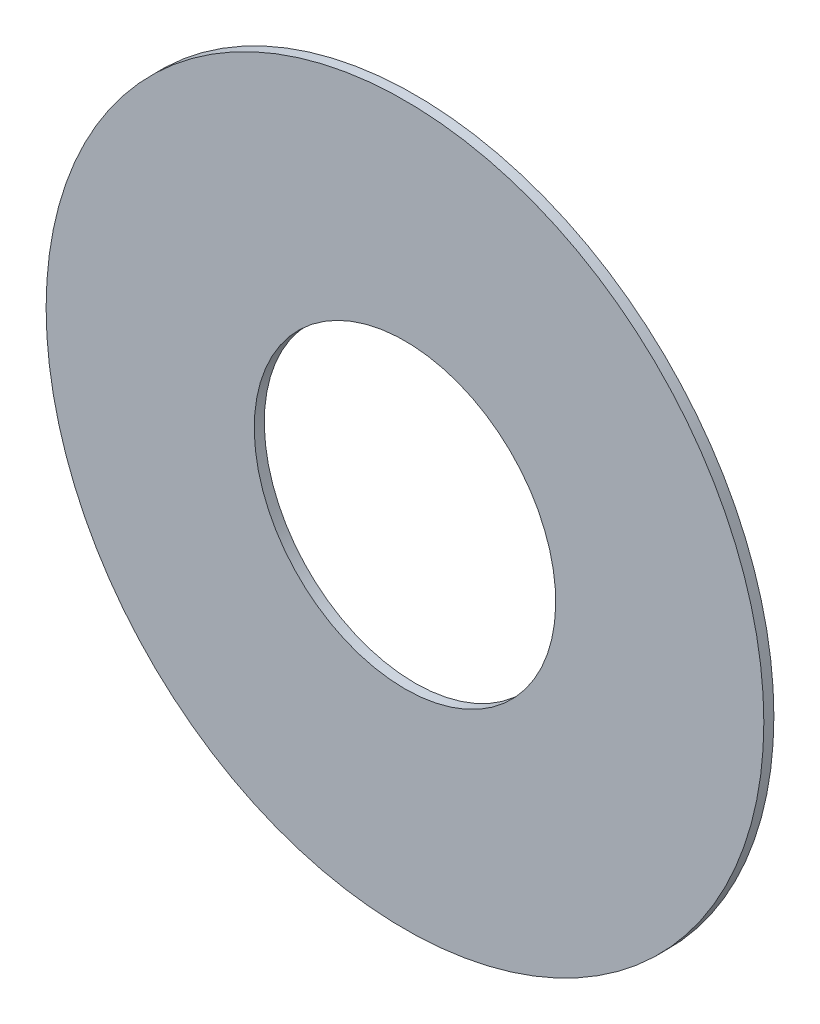
ISO-10303-21;
HEADER;
FILE_DESCRIPTION(('STEP AP214'),'2;1');
FILE_NAME('part.step','',(''),(''),'','','');
FILE_SCHEMA(('AUTOMOTIVE_DESIGN { 1 0 10303 214 1 1 1 1 }'));
ENDSEC;
DATA;
#1=APPLICATION_CONTEXT('core data for automotive mechanical design processes');
#2=APPLICATION_PROTOCOL_DEFINITION('international standard','automotive_design',2000,#1);
#3=PRODUCT_CONTEXT('',#1,'mechanical');
#4=PRODUCT('Part','Part','',(#3));
#5=PRODUCT_RELATED_PRODUCT_CATEGORY('part','',(#4));
#6=PRODUCT_DEFINITION_FORMATION('','',#4);
#7=PRODUCT_DEFINITION_CONTEXT('part definition',#1,'design');
#8=PRODUCT_DEFINITION('design','',#6,#7);
#9=PRODUCT_DEFINITION_SHAPE('','',#8);
#10=(LENGTH_UNIT() NAMED_UNIT(*) SI_UNIT(.MILLI.,.METRE.));
#11=(NAMED_UNIT(*) PLANE_ANGLE_UNIT() SI_UNIT($,.RADIAN.));
#12=(NAMED_UNIT(*) SI_UNIT($,.STERADIAN.) SOLID_ANGLE_UNIT());
#13=UNCERTAINTY_MEASURE_WITH_UNIT(LENGTH_MEASURE(1.E-05),#10,'distance_accuracy_value','');
#14=(GEOMETRIC_REPRESENTATION_CONTEXT(3) GLOBAL_UNCERTAINTY_ASSIGNED_CONTEXT((#13)) GLOBAL_UNIT_ASSIGNED_CONTEXT((#10,
#11,#12)) REPRESENTATION_CONTEXT('',''));
#15=CARTESIAN_POINT('',(0.,0.,0.));
#16=DIRECTION('',(0.,0.,1.));
#17=DIRECTION('',(1.,0.,0.));
#18=AXIS2_PLACEMENT_3D('',#15,#16,#17);
#19=CARTESIAN_POINT('',(123.952,-121.234,-0.045));
#20=DIRECTION('',(0.,0.,-1.));
#21=DIRECTION('',(0.,-1.,0.));
#22=AXIS2_PLACEMENT_3D('',#19,#20,#21);
#23=CYLINDRICAL_SURFACE('',#22,0.525);
#24=CARTESIAN_POINT('',(123.952,-121.234,-0.035));
#25=DIRECTION('',(0.,0.,-1.));
#26=DIRECTION('',(0.,-1.,0.));
#27=AXIS2_PLACEMENT_3D('',#24,#25,#26);
#28=CIRCLE('',#27,0.525);
#29=CARTESIAN_POINT('',(123.952,-121.759,-0.035));
#30=VERTEX_POINT('',#29);
#31=EDGE_CURVE('E25',#30,#30,#28,.T.);
#32=ORIENTED_EDGE('',*,*,#31,.T.);
#33=DIRECTION('',(0.,0.,1.));
#34=VECTOR('',#33,1.);
#35=CARTESIAN_POINT('',(123.952,-121.759,-0.045));
#36=LINE('',#35,#34);
#37=CARTESIAN_POINT('',(123.952,-121.759,0.));
#38=VERTEX_POINT('',#37);
#39=EDGE_CURVE('E11',#30,#38,#36,.T.);
#40=ORIENTED_EDGE('',*,*,#39,.T.);
#41=CARTESIAN_POINT('',(123.952,-121.234,0.));
#42=DIRECTION('',(0.,0.,-1.));
#43=DIRECTION('',(0.,-1.,0.));
#44=AXIS2_PLACEMENT_3D('',#41,#42,#43);
#45=CIRCLE('',#44,0.525);
#46=EDGE_CURVE('E68',#38,#38,#45,.T.);
#47=ORIENTED_EDGE('',*,*,#46,.F.);
#48=ORIENTED_EDGE('',*,*,#39,.F.);
#49=EDGE_LOOP('',(#32,#40,#47,#48));
#50=FACE_BOUND('',#49,.T.);
#51=ADVANCED_FACE('F17',(#50),#23,.F.);
#52=CARTESIAN_POINT('',(123.952,-121.234,-0.035));
#53=DIRECTION('',(0.,0.,1.));
#54=DIRECTION('',(1.,0.,0.));
#55=AXIS2_PLACEMENT_3D('',#52,#53,#54);
#56=PLANE('',#55);
#57=ORIENTED_EDGE('',*,*,#31,.F.);
#58=EDGE_LOOP('',(#57));
#59=FACE_BOUND('',#58,.T.);
#60=CARTESIAN_POINT('',(123.952,-121.234,-0.035));
#61=DIRECTION('',(0.,0.,1.));
#62=DIRECTION('',(1.,0.,0.));
#63=AXIS2_PLACEMENT_3D('',#60,#61,#62);
#64=CIRCLE('',#63,1.25);
#65=CARTESIAN_POINT('',(125.202,-121.234,-0.035));
#66=VERTEX_POINT('',#65);
#67=EDGE_CURVE('E56',#66,#66,#64,.T.);
#68=ORIENTED_EDGE('',*,*,#67,.F.);
#69=EDGE_LOOP('',(#68));
#70=FACE_BOUND('',#69,.T.);
#71=ADVANCED_FACE('F76',(#59,#70),#56,.F.);
#72=CARTESIAN_POINT('',(123.952,-121.234,0.));
#73=DIRECTION('',(0.,0.,1.));
#74=DIRECTION('',(1.,0.,0.));
#75=AXIS2_PLACEMENT_3D('',#72,#73,#74);
#76=PLANE('',#75);
#77=ORIENTED_EDGE('',*,*,#46,.T.);
#78=EDGE_LOOP('',(#77));
#79=FACE_BOUND('',#78,.T.);
#80=CARTESIAN_POINT('',(123.952,-121.234,0.));
#81=DIRECTION('',(0.,0.,1.));
#82=DIRECTION('',(1.,0.,0.));
#83=AXIS2_PLACEMENT_3D('',#80,#81,#82);
#84=CIRCLE('',#83,1.25);
#85=CARTESIAN_POINT('',(125.202,-121.234,0.));
#86=VERTEX_POINT('',#85);
#87=EDGE_CURVE('E54',#86,#86,#84,.T.);
#88=ORIENTED_EDGE('',*,*,#87,.T.);
#89=EDGE_LOOP('',(#88));
#90=FACE_BOUND('',#89,.T.);
#91=ADVANCED_FACE('F60',(#79,#90),#76,.T.);
#92=CARTESIAN_POINT('',(123.952,-121.234,-0.035));
#93=DIRECTION('',(0.,0.,1.));
#94=DIRECTION('',(1.,0.,0.));
#95=AXIS2_PLACEMENT_3D('',#92,#93,#94);
#96=CYLINDRICAL_SURFACE('',#95,1.25);
#97=ORIENTED_EDGE('',*,*,#87,.F.);
#98=DIRECTION('',(0.,0.,1.));
#99=VECTOR('',#98,1.);
#100=CARTESIAN_POINT('',(125.202,-121.234,-0.035));
#101=LINE('',#100,#99);
#102=EDGE_CURVE('E51',#66,#86,#101,.T.);
#103=ORIENTED_EDGE('',*,*,#102,.F.);
#104=ORIENTED_EDGE('',*,*,#67,.T.);
#105=ORIENTED_EDGE('',*,*,#102,.T.);
#106=EDGE_LOOP('',(#97,#103,#104,#105));
#107=FACE_BOUND('',#106,.T.);
#108=ADVANCED_FACE('F53',(#107),#96,.T.);
#109=CLOSED_SHELL('',(#51,#71,#91,#108));
#110=MANIFOLD_SOLID_BREP('B1',#109);
#111=ADVANCED_BREP_SHAPE_REPRESENTATION('',(#18,#110),#14);
#112=SHAPE_DEFINITION_REPRESENTATION(#9,#111);
ENDSEC;
END-ISO-10303-21;
